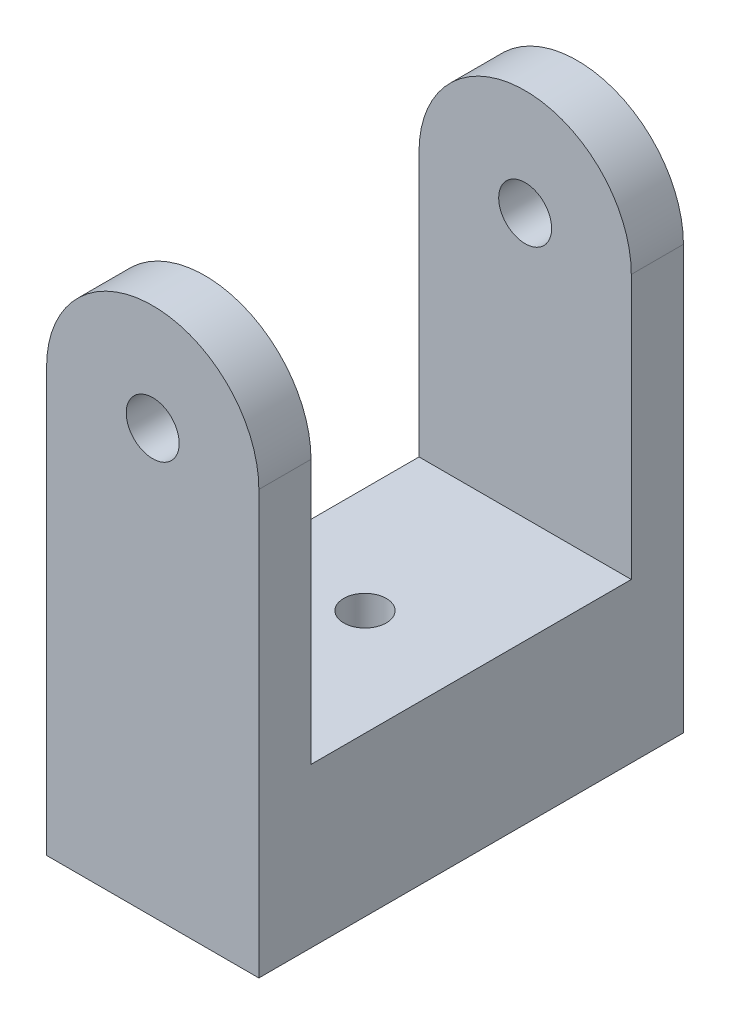
ISO-10303-21;
HEADER;
FILE_DESCRIPTION(('STEP AP214'),'2;1');
FILE_NAME('part.step','',(''),(''),'','','');
FILE_SCHEMA(('AUTOMOTIVE_DESIGN { 1 0 10303 214 1 1 1 1 }'));
ENDSEC;
DATA;
#1=APPLICATION_CONTEXT('core data for automotive mechanical design processes');
#2=APPLICATION_PROTOCOL_DEFINITION('international standard','automotive_design',2000,#1);
#3=PRODUCT_CONTEXT('',#1,'mechanical');
#4=PRODUCT('Part','Part','',(#3));
#5=PRODUCT_RELATED_PRODUCT_CATEGORY('part','',(#4));
#6=PRODUCT_DEFINITION_FORMATION('','',#4);
#7=PRODUCT_DEFINITION_CONTEXT('part definition',#1,'design');
#8=PRODUCT_DEFINITION('design','',#6,#7);
#9=PRODUCT_DEFINITION_SHAPE('','',#8);
#10=(LENGTH_UNIT() NAMED_UNIT(*) SI_UNIT(.MILLI.,.METRE.));
#11=(NAMED_UNIT(*) PLANE_ANGLE_UNIT() SI_UNIT($,.RADIAN.));
#12=(NAMED_UNIT(*) SI_UNIT($,.STERADIAN.) SOLID_ANGLE_UNIT());
#13=UNCERTAINTY_MEASURE_WITH_UNIT(LENGTH_MEASURE(1.E-05),#10,'distance_accuracy_value','');
#14=(GEOMETRIC_REPRESENTATION_CONTEXT(3) GLOBAL_UNCERTAINTY_ASSIGNED_CONTEXT((#13)) GLOBAL_UNIT_ASSIGNED_CONTEXT((#10,
#11,#12)) REPRESENTATION_CONTEXT('',''));
#15=CARTESIAN_POINT('',(0.,0.,0.));
#16=DIRECTION('',(0.,0.,1.));
#17=DIRECTION('',(1.,0.,0.));
#18=AXIS2_PLACEMENT_3D('',#15,#16,#17);
#19=CARTESIAN_POINT('',(-4.28490716489145,14.0051155875148,50.9));
#20=DIRECTION('',(0.,0.,-1.));
#21=DIRECTION('',(-1.,0.,0.));
#22=AXIS2_PLACEMENT_3D('',#19,#20,#21);
#23=CYLINDRICAL_SURFACE('',#22,12.725);
#24=DIRECTION('',(0.,0.,-1.));
#25=VECTOR('',#24,1.);
#26=CARTESIAN_POINT('',(8.44009283510855,14.0051155875148,50.9));
#27=LINE('',#26,#25);
#28=CARTESIAN_POINT('',(8.44009283510855,14.0051155875148,50.9));
#29=VERTEX_POINT('',#28);
#30=CARTESIAN_POINT('',(8.44009283510855,14.0051155875148,44.65));
#31=VERTEX_POINT('',#30);
#32=EDGE_CURVE('E173',#29,#31,#27,.T.);
#33=ORIENTED_EDGE('',*,*,#32,.T.);
#34=CARTESIAN_POINT('',(-4.28490716489145,14.0051155875148,44.65));
#35=DIRECTION('',(0.,0.,1.));
#36=DIRECTION('',(1.,0.,0.));
#37=AXIS2_PLACEMENT_3D('',#34,#35,#36);
#38=CIRCLE('',#37,12.725);
#39=CARTESIAN_POINT('',(-17.0099071648915,14.0051155875148,44.65));
#40=VERTEX_POINT('',#39);
#41=EDGE_CURVE('E150',#31,#40,#38,.T.);
#42=ORIENTED_EDGE('',*,*,#41,.T.);
#43=DIRECTION('',(0.,0.,-1.));
#44=VECTOR('',#43,1.);
#45=CARTESIAN_POINT('',(-17.0099071648915,14.0051155875148,50.9));
#46=LINE('',#45,#44);
#47=CARTESIAN_POINT('',(-17.0099071648915,14.0051155875148,50.9));
#48=VERTEX_POINT('',#47);
#49=EDGE_CURVE('E133',#48,#40,#46,.T.);
#50=ORIENTED_EDGE('',*,*,#49,.F.);
#51=CARTESIAN_POINT('',(-4.28490716489145,14.0051155875148,50.9));
#52=DIRECTION('',(0.,0.,1.));
#53=DIRECTION('',(1.,0.,0.));
#54=AXIS2_PLACEMENT_3D('',#51,#52,#53);
#55=CIRCLE('',#54,12.725);
#56=EDGE_CURVE('E55',#29,#48,#55,.T.);
#57=ORIENTED_EDGE('',*,*,#56,.F.);
#58=EDGE_LOOP('',(#33,#42,#50,#57));
#59=FACE_BOUND('',#58,.T.);
#60=ADVANCED_FACE('F36',(#59),#23,.T.);
#61=CARTESIAN_POINT('',(-4.28490716489145,14.0051155875148,50.9));
#62=DIRECTION('',(0.,0.,-1.));
#63=DIRECTION('',(-1.,0.,0.));
#64=AXIS2_PLACEMENT_3D('',#61,#62,#63);
#65=CYLINDRICAL_SURFACE('',#64,3.175);
#66=CARTESIAN_POINT('',(-4.28490716489145,14.0051155875148,44.65));
#67=DIRECTION('',(0.,0.,1.));
#68=DIRECTION('',(1.,0.,0.));
#69=AXIS2_PLACEMENT_3D('',#66,#67,#68);
#70=CIRCLE('',#69,3.175);
#71=CARTESIAN_POINT('',(-1.10990716489145,14.0051155875148,44.65));
#72=VERTEX_POINT('',#71);
#73=EDGE_CURVE('E40',#72,#72,#70,.T.);
#74=ORIENTED_EDGE('',*,*,#73,.F.);
#75=EDGE_LOOP('',(#74));
#76=FACE_BOUND('',#75,.T.);
#77=CARTESIAN_POINT('',(-4.28490716489145,14.0051155875148,50.9));
#78=DIRECTION('',(0.,0.,1.));
#79=DIRECTION('',(1.,0.,0.));
#80=AXIS2_PLACEMENT_3D('',#77,#78,#79);
#81=CIRCLE('',#80,3.175);
#82=CARTESIAN_POINT('',(-1.10990716489145,14.0051155875148,50.9));
#83=VERTEX_POINT('',#82);
#84=EDGE_CURVE('E153',#83,#83,#81,.T.);
#85=ORIENTED_EDGE('',*,*,#84,.T.);
#86=EDGE_LOOP('',(#85));
#87=FACE_BOUND('',#86,.T.);
#88=ADVANCED_FACE('F188',(#76,#87),#65,.F.);
#89=CARTESIAN_POINT('',(-4.28490716489145,14.0051155875148,50.9));
#90=DIRECTION('',(0.,0.,1.));
#91=DIRECTION('',(1.,0.,0.));
#92=AXIS2_PLACEMENT_3D('',#89,#90,#91);
#93=PLANE('',#92);
#94=DIRECTION('',(0.,-1.,0.));
#95=VECTOR('',#94,1.);
#96=CARTESIAN_POINT('',(-17.0099071648915,14.0051155875148,50.9));
#97=LINE('',#96,#95);
#98=CARTESIAN_POINT('',(-17.0099071648915,-36.7198844124852,50.9));
#99=VERTEX_POINT('',#98);
#100=EDGE_CURVE('E159',#48,#99,#97,.T.);
#101=ORIENTED_EDGE('',*,*,#100,.T.);
#102=DIRECTION('',(1.,0.,0.));
#103=VECTOR('',#102,1.);
#104=CARTESIAN_POINT('',(-17.0099071648915,-36.7198844124852,50.9));
#105=LINE('',#104,#103);
#106=CARTESIAN_POINT('',(8.44009283510855,-36.7198844124852,50.9));
#107=VERTEX_POINT('',#106);
#108=EDGE_CURVE('E87',#99,#107,#105,.T.);
#109=ORIENTED_EDGE('',*,*,#108,.T.);
#110=DIRECTION('',(0.,1.,0.));
#111=VECTOR('',#110,1.);
#112=CARTESIAN_POINT('',(8.44009283510855,-36.7198844124852,50.9));
#113=LINE('',#112,#111);
#114=EDGE_CURVE('E163',#107,#29,#113,.T.);
#115=ORIENTED_EDGE('',*,*,#114,.T.);
#116=ORIENTED_EDGE('',*,*,#56,.T.);
#117=EDGE_LOOP('',(#101,#109,#115,#116));
#118=FACE_BOUND('',#117,.T.);
#119=ORIENTED_EDGE('',*,*,#84,.F.);
#120=EDGE_LOOP('',(#119));
#121=FACE_BOUND('',#120,.T.);
#122=ADVANCED_FACE('F193',(#118,#121),#93,.T.);
#123=CARTESIAN_POINT('',(-4.28490716489145,14.0051155875148,0.));
#124=DIRECTION('',(0.,0.,1.));
#125=DIRECTION('',(1.,0.,0.));
#126=AXIS2_PLACEMENT_3D('',#123,#124,#125);
#127=PLANE('',#126);
#128=DIRECTION('',(0.,-1.,0.));
#129=VECTOR('',#128,1.);
#130=CARTESIAN_POINT('',(-17.0099071648915,14.0051155875148,0.));
#131=LINE('',#130,#129);
#132=CARTESIAN_POINT('',(-17.0099071648915,14.0051155875148,0.));
#133=VERTEX_POINT('',#132);
#134=CARTESIAN_POINT('',(-17.0099071648915,-36.7198844124852,0.));
#135=VERTEX_POINT('',#134);
#136=EDGE_CURVE('E156',#133,#135,#131,.T.);
#137=ORIENTED_EDGE('',*,*,#136,.F.);
#138=CARTESIAN_POINT('',(-4.28490716489145,14.0051155875148,0.));
#139=DIRECTION('',(0.,0.,1.));
#140=DIRECTION('',(1.,0.,0.));
#141=AXIS2_PLACEMENT_3D('',#138,#139,#140);
#142=CIRCLE('',#141,12.725);
#143=CARTESIAN_POINT('',(8.44009283510855,14.0051155875148,0.));
#144=VERTEX_POINT('',#143);
#145=EDGE_CURVE('E161',#144,#133,#142,.T.);
#146=ORIENTED_EDGE('',*,*,#145,.F.);
#147=DIRECTION('',(0.,1.,0.));
#148=VECTOR('',#147,1.);
#149=CARTESIAN_POINT('',(8.44009283510855,-36.7198844124852,0.));
#150=LINE('',#149,#148);
#151=CARTESIAN_POINT('',(8.44009283510855,-36.7198844124852,0.));
#152=VERTEX_POINT('',#151);
#153=EDGE_CURVE('E169',#152,#144,#150,.T.);
#154=ORIENTED_EDGE('',*,*,#153,.F.);
#155=DIRECTION('',(1.,0.,0.));
#156=VECTOR('',#155,1.);
#157=CARTESIAN_POINT('',(-17.0099071648915,-36.7198844124852,0.));
#158=LINE('',#157,#156);
#159=EDGE_CURVE('E167',#135,#152,#158,.T.);
#160=ORIENTED_EDGE('',*,*,#159,.F.);
#161=EDGE_LOOP('',(#137,#146,#154,#160));
#162=FACE_BOUND('',#161,.T.);
#163=CARTESIAN_POINT('',(-4.28490716489145,14.0051155875148,0.));
#164=DIRECTION('',(0.,0.,1.));
#165=DIRECTION('',(1.,0.,0.));
#166=AXIS2_PLACEMENT_3D('',#163,#164,#165);
#167=CIRCLE('',#166,3.175);
#168=CARTESIAN_POINT('',(-1.10990716489145,14.0051155875148,0.));
#169=VERTEX_POINT('',#168);
#170=EDGE_CURVE('E152',#169,#169,#167,.T.);
#171=ORIENTED_EDGE('',*,*,#170,.T.);
#172=EDGE_LOOP('',(#171));
#173=FACE_BOUND('',#172,.T.);
#174=ADVANCED_FACE('F191',(#162,#173),#127,.F.);
#175=CARTESIAN_POINT('',(-17.0099071648915,14.0051155875148,50.9));
#176=DIRECTION('',(1.,0.,0.));
#177=DIRECTION('',(0.,0.,-1.));
#178=AXIS2_PLACEMENT_3D('',#175,#176,#177);
#179=PLANE('',#178);
#180=ORIENTED_EDGE('',*,*,#49,.T.);
#181=DIRECTION('',(0.,-1.,0.));
#182=VECTOR('',#181,1.);
#183=CARTESIAN_POINT('',(-17.0099071648915,26.7301155875148,44.65));
#184=LINE('',#183,#182);
#185=CARTESIAN_POINT('',(-17.0099071648915,-17.6698844124852,44.65));
#186=VERTEX_POINT('',#185);
#187=EDGE_CURVE('E117',#40,#186,#184,.T.);
#188=ORIENTED_EDGE('',*,*,#187,.T.);
#189=DIRECTION('',(0.,0.,-1.));
#190=VECTOR('',#189,1.);
#191=CARTESIAN_POINT('',(-17.0099071648915,-17.6698844124852,44.65));
#192=LINE('',#191,#190);
#193=CARTESIAN_POINT('',(-17.0099071648915,-17.6698844124852,6.25));
#194=VERTEX_POINT('',#193);
#195=EDGE_CURVE('E128',#186,#194,#192,.T.);
#196=ORIENTED_EDGE('',*,*,#195,.T.);
#197=DIRECTION('',(0.,1.,0.));
#198=VECTOR('',#197,1.);
#199=CARTESIAN_POINT('',(-17.0099071648915,26.7301155875148,6.25000000000001));
#200=LINE('',#199,#198);
#201=CARTESIAN_POINT('',(-17.0099071648915,14.0051155875148,6.25));
#202=VERTEX_POINT('',#201);
#203=EDGE_CURVE('E125',#194,#202,#200,.T.);
#204=ORIENTED_EDGE('',*,*,#203,.T.);
#205=EDGE_CURVE('E81',#202,#133,#46,.T.);
#206=ORIENTED_EDGE('',*,*,#205,.T.);
#207=ORIENTED_EDGE('',*,*,#136,.T.);
#208=DIRECTION('',(0.,0.,-1.));
#209=VECTOR('',#208,1.);
#210=CARTESIAN_POINT('',(-17.0099071648915,-36.7198844124852,50.9));
#211=LINE('',#210,#209);
#212=EDGE_CURVE('E11',#99,#135,#211,.T.);
#213=ORIENTED_EDGE('',*,*,#212,.F.);
#214=ORIENTED_EDGE('',*,*,#100,.F.);
#215=EDGE_LOOP('',(#180,#188,#196,#204,#206,#207,#213,#214));
#216=FACE_BOUND('',#215,.T.);
#217=ADVANCED_FACE('F38',(#216),#179,.F.);
#218=CARTESIAN_POINT('',(-17.0099071648915,-36.7198844124852,50.9));
#219=DIRECTION('',(0.,1.,0.));
#220=DIRECTION('',(0.,0.,1.));
#221=AXIS2_PLACEMENT_3D('',#218,#219,#220);
#222=PLANE('',#221);
#223=CARTESIAN_POINT('',(-4.28490716489145,-36.7198844124852,25.45));
#224=DIRECTION('',(0.,-1.,0.));
#225=DIRECTION('',(0.,0.,-1.));
#226=AXIS2_PLACEMENT_3D('',#223,#224,#225);
#227=CIRCLE('',#226,2.5527);
#228=CARTESIAN_POINT('',(-4.28490716489145,-36.7198844124852,22.8973));
#229=VERTEX_POINT('',#228);
#230=EDGE_CURVE('E232',#229,#229,#227,.T.);
#231=ORIENTED_EDGE('',*,*,#230,.F.);
#232=EDGE_LOOP('',(#231));
#233=FACE_BOUND('',#232,.T.);
#234=ORIENTED_EDGE('',*,*,#159,.T.);
#235=DIRECTION('',(0.,0.,-1.));
#236=VECTOR('',#235,1.);
#237=CARTESIAN_POINT('',(8.44009283510855,-36.7198844124852,50.9));
#238=LINE('',#237,#236);
#239=EDGE_CURVE('E46',#107,#152,#238,.T.);
#240=ORIENTED_EDGE('',*,*,#239,.F.);
#241=ORIENTED_EDGE('',*,*,#108,.F.);
#242=ORIENTED_EDGE('',*,*,#212,.T.);
#243=EDGE_LOOP('',(#234,#240,#241,#242));
#244=FACE_BOUND('',#243,.T.);
#245=ADVANCED_FACE('F200',(#233,#244),#222,.F.);
#246=CARTESIAN_POINT('',(8.44009283510855,-36.7198844124852,50.9));
#247=DIRECTION('',(-1.,0.,0.));
#248=DIRECTION('',(0.,0.,1.));
#249=AXIS2_PLACEMENT_3D('',#246,#247,#248);
#250=PLANE('',#249);
#251=DIRECTION('',(0.,0.,-1.));
#252=VECTOR('',#251,1.);
#253=CARTESIAN_POINT('',(8.44009283510855,-17.6698844124852,44.65));
#254=LINE('',#253,#252);
#255=CARTESIAN_POINT('',(8.44009283510855,-17.6698844124852,44.65));
#256=VERTEX_POINT('',#255);
#257=CARTESIAN_POINT('',(8.44009283510855,-17.6698844124852,6.25));
#258=VERTEX_POINT('',#257);
#259=EDGE_CURVE('E137',#256,#258,#254,.T.);
#260=ORIENTED_EDGE('',*,*,#259,.F.);
#261=DIRECTION('',(0.,-1.,0.));
#262=VECTOR('',#261,1.);
#263=CARTESIAN_POINT('',(8.44009283510855,26.7301155875148,44.65));
#264=LINE('',#263,#262);
#265=EDGE_CURVE('E120',#31,#256,#264,.T.);
#266=ORIENTED_EDGE('',*,*,#265,.F.);
#267=ORIENTED_EDGE('',*,*,#32,.F.);
#268=ORIENTED_EDGE('',*,*,#114,.F.);
#269=ORIENTED_EDGE('',*,*,#239,.T.);
#270=ORIENTED_EDGE('',*,*,#153,.T.);
#271=CARTESIAN_POINT('',(8.44009283510855,14.0051155875148,6.25));
#272=VERTEX_POINT('',#271);
#273=EDGE_CURVE('E73',#272,#144,#27,.T.);
#274=ORIENTED_EDGE('',*,*,#273,.F.);
#275=DIRECTION('',(0.,1.,0.));
#276=VECTOR('',#275,1.);
#277=CARTESIAN_POINT('',(8.44009283510855,26.7301155875148,6.25000000000001));
#278=LINE('',#277,#276);
#279=EDGE_CURVE('E134',#258,#272,#278,.T.);
#280=ORIENTED_EDGE('',*,*,#279,.F.);
#281=EDGE_LOOP('',(#260,#266,#267,#268,#269,#270,#274,#280));
#282=FACE_BOUND('',#281,.T.);
#283=ADVANCED_FACE('F212',(#282),#250,.F.);
#284=CARTESIAN_POINT('',(-4.28490716489145,14.0051155875148,6.25000000000001));
#285=DIRECTION('',(0.,0.,-1.));
#286=DIRECTION('',(0.,1.,0.));
#287=AXIS2_PLACEMENT_3D('',#284,#285,#286);
#288=CIRCLE('',#287,12.725);
#289=EDGE_CURVE('E148',#202,#272,#288,.T.);
#290=ORIENTED_EDGE('',*,*,#289,.T.);
#291=ORIENTED_EDGE('',*,*,#273,.T.);
#292=ORIENTED_EDGE('',*,*,#145,.T.);
#293=ORIENTED_EDGE('',*,*,#205,.F.);
#294=EDGE_LOOP('',(#290,#291,#292,#293));
#295=FACE_BOUND('',#294,.T.);
#296=ADVANCED_FACE('F186',(#295),#23,.T.);
#297=CARTESIAN_POINT('',(-4.28490716489145,14.0051155875148,6.25000000000001));
#298=DIRECTION('',(0.,0.,-1.));
#299=DIRECTION('',(0.,1.,0.));
#300=AXIS2_PLACEMENT_3D('',#297,#298,#299);
#301=CIRCLE('',#300,3.175);
#302=CARTESIAN_POINT('',(-4.28490716489145,17.1801155875148,6.25000000000001));
#303=VERTEX_POINT('',#302);
#304=EDGE_CURVE('E146',#303,#303,#301,.T.);
#305=ORIENTED_EDGE('',*,*,#304,.F.);
#306=EDGE_LOOP('',(#305));
#307=FACE_BOUND('',#306,.T.);
#308=ORIENTED_EDGE('',*,*,#170,.F.);
#309=EDGE_LOOP('',(#308));
#310=FACE_BOUND('',#309,.T.);
#311=ADVANCED_FACE('F183',(#307,#310),#65,.F.);
#312=CARTESIAN_POINT('',(-17.0099071648915,26.7301155875148,44.65));
#313=DIRECTION('',(0.,0.,1.));
#314=DIRECTION('',(1.,0.,0.));
#315=AXIS2_PLACEMENT_3D('',#312,#313,#314);
#316=PLANE('',#315);
#317=ORIENTED_EDGE('',*,*,#73,.T.);
#318=EDGE_LOOP('',(#317));
#319=FACE_BOUND('',#318,.T.);
#320=ORIENTED_EDGE('',*,*,#265,.T.);
#321=DIRECTION('',(1.,0.,0.));
#322=VECTOR('',#321,1.);
#323=CARTESIAN_POINT('',(-17.0099071648915,-17.6698844124852,44.65));
#324=LINE('',#323,#322);
#325=EDGE_CURVE('E113',#186,#256,#324,.T.);
#326=ORIENTED_EDGE('',*,*,#325,.F.);
#327=ORIENTED_EDGE('',*,*,#187,.F.);
#328=ORIENTED_EDGE('',*,*,#41,.F.);
#329=EDGE_LOOP('',(#320,#326,#327,#328));
#330=FACE_BOUND('',#329,.T.);
#331=ADVANCED_FACE('F115',(#319,#330),#316,.F.);
#332=CARTESIAN_POINT('',(-17.0099071648915,26.7301155875148,6.25000000000001));
#333=DIRECTION('',(0.,0.,-1.));
#334=DIRECTION('',(0.,1.,0.));
#335=AXIS2_PLACEMENT_3D('',#332,#333,#334);
#336=PLANE('',#335);
#337=ORIENTED_EDGE('',*,*,#304,.T.);
#338=EDGE_LOOP('',(#337));
#339=FACE_BOUND('',#338,.T.);
#340=ORIENTED_EDGE('',*,*,#289,.F.);
#341=ORIENTED_EDGE('',*,*,#203,.F.);
#342=DIRECTION('',(1.,0.,0.));
#343=VECTOR('',#342,1.);
#344=CARTESIAN_POINT('',(-17.0099071648915,-17.6698844124852,6.25));
#345=LINE('',#344,#343);
#346=EDGE_CURVE('E124',#194,#258,#345,.T.);
#347=ORIENTED_EDGE('',*,*,#346,.T.);
#348=ORIENTED_EDGE('',*,*,#279,.T.);
#349=EDGE_LOOP('',(#340,#341,#347,#348));
#350=FACE_BOUND('',#349,.T.);
#351=ADVANCED_FACE('F180',(#339,#350),#336,.F.);
#352=CARTESIAN_POINT('',(-17.0099071648915,-17.6698844124852,44.65));
#353=DIRECTION('',(0.,-1.,0.));
#354=DIRECTION('',(0.,0.,-1.));
#355=AXIS2_PLACEMENT_3D('',#352,#353,#354);
#356=PLANE('',#355);
#357=CARTESIAN_POINT('',(-4.28490716489145,-17.6698844124852,25.45));
#358=DIRECTION('',(0.,-1.,0.));
#359=DIRECTION('',(0.,0.,-1.));
#360=AXIS2_PLACEMENT_3D('',#357,#358,#359);
#361=CIRCLE('',#360,2.5527);
#362=CARTESIAN_POINT('',(-4.28490716489145,-17.6698844124852,22.8973));
#363=VERTEX_POINT('',#362);
#364=EDGE_CURVE('E140',#363,#363,#361,.T.);
#365=ORIENTED_EDGE('',*,*,#364,.T.);
#366=EDGE_LOOP('',(#365));
#367=FACE_BOUND('',#366,.T.);
#368=ORIENTED_EDGE('',*,*,#259,.T.);
#369=ORIENTED_EDGE('',*,*,#346,.F.);
#370=ORIENTED_EDGE('',*,*,#195,.F.);
#371=ORIENTED_EDGE('',*,*,#325,.T.);
#372=EDGE_LOOP('',(#368,#369,#370,#371));
#373=FACE_BOUND('',#372,.T.);
#374=ADVANCED_FACE('F129',(#367,#373),#356,.F.);
#375=CARTESIAN_POINT('',(-4.28490716489145,-36.7198844124852,25.45));
#376=DIRECTION('',(0.,-1.,0.));
#377=DIRECTION('',(0.,0.,-1.));
#378=AXIS2_PLACEMENT_3D('',#375,#376,#377);
#379=CYLINDRICAL_SURFACE('',#378,2.5527);
#380=ORIENTED_EDGE('',*,*,#230,.T.);
#381=EDGE_LOOP('',(#380));
#382=FACE_BOUND('',#381,.T.);
#383=ORIENTED_EDGE('',*,*,#364,.F.);
#384=EDGE_LOOP('',(#383));
#385=FACE_BOUND('',#384,.T.);
#386=ADVANCED_FACE('F238',(#382,#385),#379,.F.);
#387=CLOSED_SHELL('',(#60,#88,#122,#174,#217,#245,#283,#296,#311,#331,#351,#374,#386));
#388=MANIFOLD_SOLID_BREP('B2',#387);
#389=ADVANCED_BREP_SHAPE_REPRESENTATION('',(#18,#388),#14);
#390=SHAPE_DEFINITION_REPRESENTATION(#9,#389);
ENDSEC;
END-ISO-10303-21;
